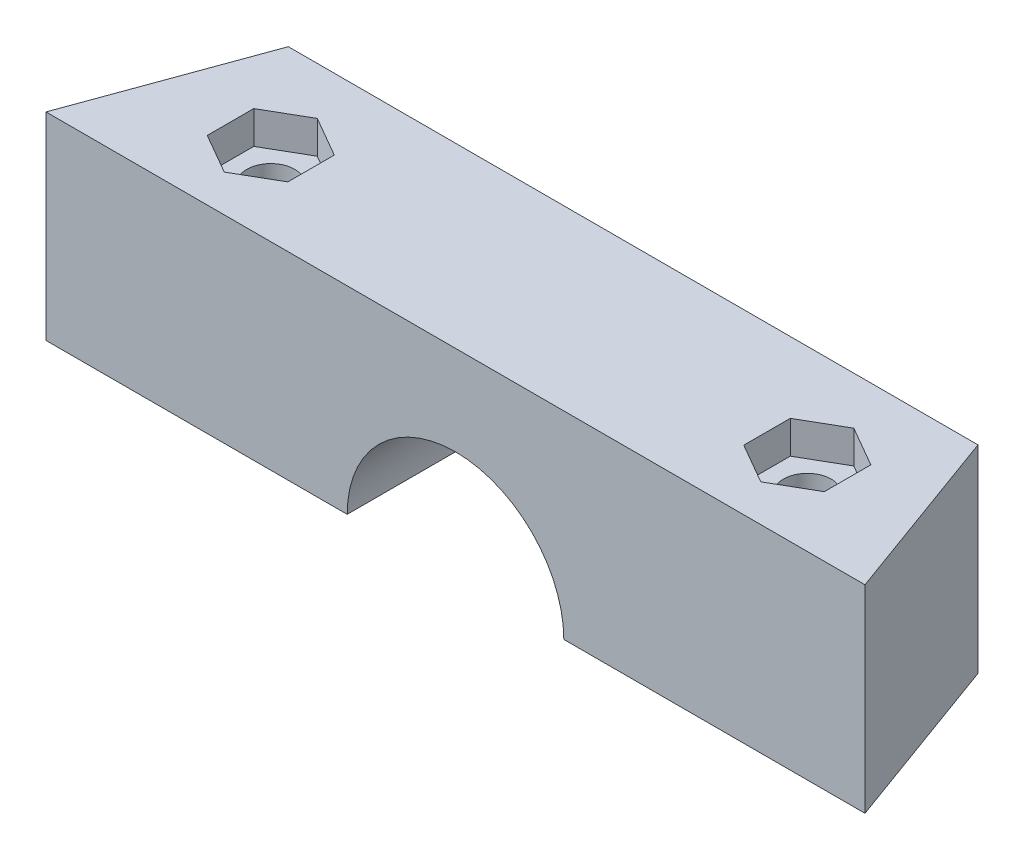
ISO-10303-21;
HEADER;
FILE_DESCRIPTION(('STEP AP214'),'2;1');
FILE_NAME('part.step','',(''),(''),'','','');
FILE_SCHEMA(('AUTOMOTIVE_DESIGN { 1 0 10303 214 1 1 1 1 }'));
ENDSEC;
DATA;
#1=APPLICATION_CONTEXT('core data for automotive mechanical design processes');
#2=APPLICATION_PROTOCOL_DEFINITION('international standard','automotive_design',2000,#1);
#3=PRODUCT_CONTEXT('',#1,'mechanical');
#4=PRODUCT('Part','Part','',(#3));
#5=PRODUCT_RELATED_PRODUCT_CATEGORY('part','',(#4));
#6=PRODUCT_DEFINITION_FORMATION('','',#4);
#7=PRODUCT_DEFINITION_CONTEXT('part definition',#1,'design');
#8=PRODUCT_DEFINITION('design','',#6,#7);
#9=PRODUCT_DEFINITION_SHAPE('','',#8);
#10=(LENGTH_UNIT() NAMED_UNIT(*) SI_UNIT(.MILLI.,.METRE.));
#11=(NAMED_UNIT(*) PLANE_ANGLE_UNIT() SI_UNIT($,.RADIAN.));
#12=(NAMED_UNIT(*) SI_UNIT($,.STERADIAN.) SOLID_ANGLE_UNIT());
#13=UNCERTAINTY_MEASURE_WITH_UNIT(LENGTH_MEASURE(1.E-05),#10,'distance_accuracy_value','');
#14=(GEOMETRIC_REPRESENTATION_CONTEXT(3) GLOBAL_UNCERTAINTY_ASSIGNED_CONTEXT((#13)) GLOBAL_UNIT_ASSIGNED_CONTEXT((#10,
#11,#12)) REPRESENTATION_CONTEXT('',''));
#15=CARTESIAN_POINT('',(0.,0.,0.));
#16=DIRECTION('',(0.,0.,1.));
#17=DIRECTION('',(1.,0.,0.));
#18=AXIS2_PLACEMENT_3D('',#15,#16,#17);
#19=CARTESIAN_POINT('',(0.,0.,0.));
#20=DIRECTION('',(0.,-1.,0.));
#21=DIRECTION('',(0.,0.,-1.));
#22=AXIS2_PLACEMENT_3D('',#19,#20,#21);
#23=PLANE('',#22);
#24=DIRECTION('',(-1.,0.,0.));
#25=VECTOR('',#24,1.);
#26=CARTESIAN_POINT('',(0.,0.,36.1498282890972));
#27=LINE('',#26,#25);
#28=CARTESIAN_POINT('',(18.4255159476194,0.,36.1498282890972));
#29=VERTEX_POINT('',#28);
#30=CARTESIAN_POINT('',(1.09808594402809,0.,36.1498282890972));
#31=VERTEX_POINT('',#30);
#32=EDGE_CURVE('E52',#29,#31,#27,.T.);
#33=ORIENTED_EDGE('',*,*,#32,.F.);
#34=DIRECTION('',(0.342020143325666,0.,0.939692620785909));
#35=VECTOR('',#34,1.);
#36=CARTESIAN_POINT('',(8.16308594402805,0.,7.95403358549623));
#37=LINE('',#36,#35);
#38=CARTESIAN_POINT('',(23.1630859440281,0.,49.166194877316));
#39=VERTEX_POINT('',#38);
#40=EDGE_CURVE('E259',#29,#39,#37,.T.);
#41=ORIENTED_EDGE('',*,*,#40,.T.);
#42=DIRECTION('',(-1.,0.,0.));
#43=VECTOR('',#42,1.);
#44=CARTESIAN_POINT('',(23.1630859440281,0.,49.166194877316));
#45=LINE('',#44,#43);
#46=CARTESIAN_POINT('',(1.09808594402809,0.,49.166194877316));
#47=VERTEX_POINT('',#46);
#48=EDGE_CURVE('E263',#39,#47,#45,.T.);
#49=ORIENTED_EDGE('',*,*,#48,.T.);
#50=DIRECTION('',(0.,0.,1.));
#51=VECTOR('',#50,1.);
#52=CARTESIAN_POINT('',(1.09808594402809,0.,-38.833805122684));
#53=LINE('',#52,#51);
#54=EDGE_CURVE('E45',#31,#47,#53,.T.);
#55=ORIENTED_EDGE('',*,*,#54,.F.);
#56=EDGE_LOOP('',(#33,#41,#49,#55));
#57=FACE_BOUND('',#56,.T.);
#58=DIRECTION('',(0.866025403784438,0.,-0.500000000000001));
#59=VECTOR('',#58,1.);
#60=CARTESIAN_POINT('',(9.86591170632774,0.,41.3430115832066));
#61=LINE('',#60,#59);
#62=CARTESIAN_POINT('',(9.86591170632774,0.,41.3430115832066));
#63=VERTEX_POINT('',#62);
#64=CARTESIAN_POINT('',(12.8159117063277,0.,39.6398282890972));
#65=VERTEX_POINT('',#64);
#66=EDGE_CURVE('E59',#63,#65,#61,.T.);
#67=ORIENTED_EDGE('',*,*,#66,.F.);
#68=DIRECTION('',(0.,0.,-1.));
#69=VECTOR('',#68,1.);
#70=CARTESIAN_POINT('',(9.86591170632774,0.,44.7493781714254));
#71=LINE('',#70,#69);
#72=CARTESIAN_POINT('',(9.86591170632774,0.,44.7493781714254));
#73=VERTEX_POINT('',#72);
#74=EDGE_CURVE('E347',#73,#63,#71,.T.);
#75=ORIENTED_EDGE('',*,*,#74,.F.);
#76=DIRECTION('',(-0.866025403784439,0.,-0.5));
#77=VECTOR('',#76,1.);
#78=CARTESIAN_POINT('',(12.8159117063277,0.,46.4525614655348));
#79=LINE('',#78,#77);
#80=CARTESIAN_POINT('',(12.8159117063277,0.,46.4525614655348));
#81=VERTEX_POINT('',#80);
#82=EDGE_CURVE('E373',#81,#73,#79,.T.);
#83=ORIENTED_EDGE('',*,*,#82,.F.);
#84=DIRECTION('',(-0.866025403784439,0.,0.499999999999999));
#85=VECTOR('',#84,1.);
#86=CARTESIAN_POINT('',(15.7659117063277,0.,44.7493781714254));
#87=LINE('',#86,#85);
#88=CARTESIAN_POINT('',(15.7659117063277,0.,44.7493781714254));
#89=VERTEX_POINT('',#88);
#90=EDGE_CURVE('E370',#89,#81,#87,.T.);
#91=ORIENTED_EDGE('',*,*,#90,.F.);
#92=DIRECTION('',(0.,0.,1.));
#93=VECTOR('',#92,1.);
#94=CARTESIAN_POINT('',(15.7659117063277,0.,41.3430115832066));
#95=LINE('',#94,#93);
#96=CARTESIAN_POINT('',(15.7659117063277,0.,41.3430115832066));
#97=VERTEX_POINT('',#96);
#98=EDGE_CURVE('E367',#97,#89,#95,.T.);
#99=ORIENTED_EDGE('',*,*,#98,.F.);
#100=DIRECTION('',(0.866025403784438,0.,0.500000000000001));
#101=VECTOR('',#100,1.);
#102=CARTESIAN_POINT('',(12.8159117063277,0.,39.6398282890972));
#103=LINE('',#102,#101);
#104=EDGE_CURVE('E364',#65,#97,#103,.T.);
#105=ORIENTED_EDGE('',*,*,#104,.F.);
#106=EDGE_LOOP('',(#67,#75,#83,#91,#99,#105));
#107=FACE_BOUND('',#106,.T.);
#108=ADVANCED_FACE('F37',(#57,#107),#23,.T.);
#109=CARTESIAN_POINT('',(23.1630859440281,14.5,49.166194877316));
#110=DIRECTION('',(0.,0.,1.));
#111=DIRECTION('',(1.,0.,0.));
#112=AXIS2_PLACEMENT_3D('',#109,#110,#111);
#113=PLANE('',#112);
#114=CARTESIAN_POINT('',(-6.83691405597191,0.,49.166194877316));
#115=DIRECTION('',(0.,0.,1.));
#116=DIRECTION('',(1.,0.,0.));
#117=AXIS2_PLACEMENT_3D('',#114,#115,#116);
#118=CIRCLE('',#117,7.935);
#119=CARTESIAN_POINT('',(-14.7719140559719,0.,49.166194877316));
#120=VERTEX_POINT('',#119);
#121=EDGE_CURVE('E427',#47,#120,#118,.T.);
#122=ORIENTED_EDGE('',*,*,#121,.F.);
#123=ORIENTED_EDGE('',*,*,#48,.F.);
#124=DIRECTION('',(0.,-1.,0.));
#125=VECTOR('',#124,1.);
#126=CARTESIAN_POINT('',(23.1630859440281,14.5,49.166194877316));
#127=LINE('',#126,#125);
#128=CARTESIAN_POINT('',(23.1630859440281,14.5,49.166194877316));
#129=VERTEX_POINT('',#128);
#130=EDGE_CURVE('E270',#129,#39,#127,.T.);
#131=ORIENTED_EDGE('',*,*,#130,.F.);
#132=DIRECTION('',(-1.,0.,0.));
#133=VECTOR('',#132,1.);
#134=CARTESIAN_POINT('',(23.1630859440281,14.5,49.166194877316));
#135=LINE('',#134,#133);
#136=CARTESIAN_POINT('',(-36.8369140559719,14.5,49.166194877316));
#137=VERTEX_POINT('',#136);
#138=EDGE_CURVE('E256',#129,#137,#135,.T.);
#139=ORIENTED_EDGE('',*,*,#138,.T.);
#140=DIRECTION('',(0.,-1.,0.));
#141=VECTOR('',#140,1.);
#142=CARTESIAN_POINT('',(-36.8369140559719,14.5,49.166194877316));
#143=LINE('',#142,#141);
#144=CARTESIAN_POINT('',(-36.8369140559719,0.,49.166194877316));
#145=VERTEX_POINT('',#144);
#146=EDGE_CURVE('E255',#137,#145,#143,.T.);
#147=ORIENTED_EDGE('',*,*,#146,.T.);
#148=EDGE_CURVE('E267',#120,#145,#45,.T.);
#149=ORIENTED_EDGE('',*,*,#148,.F.);
#150=EDGE_LOOP('',(#122,#123,#131,#139,#147,#149));
#151=FACE_BOUND('',#150,.T.);
#152=ADVANCED_FACE('F39',(#151),#113,.T.);
#153=CARTESIAN_POINT('',(8.16308594402805,14.5,7.95403358549623));
#154=DIRECTION('',(0.939692620785909,0.,-0.342020143325666));
#155=DIRECTION('',(-0.342020143325666,0.,-0.939692620785909));
#156=AXIS2_PLACEMENT_3D('',#153,#154,#155);
#157=PLANE('',#156);
#158=DIRECTION('',(0.,1.,0.));
#159=VECTOR('',#158,1.);
#160=CARTESIAN_POINT('',(18.4255159476194,-7.9,36.1498282890972));
#161=LINE('',#160,#159);
#162=CARTESIAN_POINT('',(18.4255159476194,14.5,36.1498282890972));
#163=VERTEX_POINT('',#162);
#164=EDGE_CURVE('E242',#29,#163,#161,.T.);
#165=ORIENTED_EDGE('',*,*,#164,.T.);
#166=DIRECTION('',(0.342020143325666,0.,0.939692620785909));
#167=VECTOR('',#166,1.);
#168=CARTESIAN_POINT('',(8.16308594402805,14.5,7.95403358549623));
#169=LINE('',#168,#167);
#170=EDGE_CURVE('E251',#163,#129,#169,.T.);
#171=ORIENTED_EDGE('',*,*,#170,.T.);
#172=ORIENTED_EDGE('',*,*,#130,.T.);
#173=ORIENTED_EDGE('',*,*,#40,.F.);
#174=EDGE_LOOP('',(#165,#171,#172,#173));
#175=FACE_BOUND('',#174,.T.);
#176=ADVANCED_FACE('F495',(#175),#157,.T.);
#177=CARTESIAN_POINT('',(-36.8369140559719,14.5,49.166194877316));
#178=DIRECTION('',(-0.93969262078591,0.,-0.342020143325665));
#179=DIRECTION('',(-0.342020143325665,0.,0.93969262078591));
#180=AXIS2_PLACEMENT_3D('',#177,#178,#179);
#181=PLANE('',#180);
#182=DIRECTION('',(0.,1.,0.));
#183=VECTOR('',#182,1.);
#184=CARTESIAN_POINT('',(-32.0993440595632,-7.9,36.1498282890972));
#185=LINE('',#184,#183);
#186=CARTESIAN_POINT('',(-32.0993440595632,0.,36.1498282890972));
#187=VERTEX_POINT('',#186);
#188=CARTESIAN_POINT('',(-32.0993440595632,14.5,36.1498282890972));
#189=VERTEX_POINT('',#188);
#190=EDGE_CURVE('E231',#187,#189,#185,.T.);
#191=ORIENTED_EDGE('',*,*,#190,.F.);
#192=DIRECTION('',(0.342020143325665,0.,-0.93969262078591));
#193=VECTOR('',#192,1.);
#194=CARTESIAN_POINT('',(-36.8369140559719,0.,49.166194877316));
#195=LINE('',#194,#193);
#196=EDGE_CURVE('E266',#145,#187,#195,.T.);
#197=ORIENTED_EDGE('',*,*,#196,.F.);
#198=ORIENTED_EDGE('',*,*,#146,.F.);
#199=DIRECTION('',(0.342020143325665,0.,-0.93969262078591));
#200=VECTOR('',#199,1.);
#201=CARTESIAN_POINT('',(-36.8369140559719,14.5,49.166194877316));
#202=LINE('',#201,#200);
#203=EDGE_CURVE('E249',#137,#189,#202,.T.);
#204=ORIENTED_EDGE('',*,*,#203,.T.);
#205=EDGE_LOOP('',(#191,#197,#198,#204));
#206=FACE_BOUND('',#205,.T.);
#207=ADVANCED_FACE('F253',(#206),#181,.T.);
#208=CARTESIAN_POINT('',(0.,14.5,0.));
#209=DIRECTION('',(0.,-1.,0.));
#210=DIRECTION('',(0.,0.,-1.));
#211=AXIS2_PLACEMENT_3D('',#208,#209,#210);
#212=PLANE('',#211);
#213=DIRECTION('',(0.866025403784439,0.,-0.5));
#214=VECTOR('',#213,1.);
#215=CARTESIAN_POINT('',(-26.4897398182716,14.5,46.4525614655348));
#216=LINE('',#215,#214);
#217=CARTESIAN_POINT('',(-26.4897398182716,14.5,46.4525614655348));
#218=VERTEX_POINT('',#217);
#219=CARTESIAN_POINT('',(-23.5397398182716,14.5,44.7493781714254));
#220=VERTEX_POINT('',#219);
#221=EDGE_CURVE('E410',#218,#220,#216,.T.);
#222=ORIENTED_EDGE('',*,*,#221,.F.);
#223=DIRECTION('',(0.866025403784439,0.,0.5));
#224=VECTOR('',#223,1.);
#225=CARTESIAN_POINT('',(-29.4397398182716,14.5,44.7493781714254));
#226=LINE('',#225,#224);
#227=CARTESIAN_POINT('',(-29.4397398182716,14.5,44.7493781714254));
#228=VERTEX_POINT('',#227);
#229=EDGE_CURVE('E408',#228,#218,#226,.T.);
#230=ORIENTED_EDGE('',*,*,#229,.F.);
#231=DIRECTION('',(0.,0.,1.));
#232=VECTOR('',#231,1.);
#233=CARTESIAN_POINT('',(-29.4397398182716,14.5,41.3430115832066));
#234=LINE('',#233,#232);
#235=CARTESIAN_POINT('',(-29.4397398182716,14.5,41.3430115832066));
#236=VERTEX_POINT('',#235);
#237=EDGE_CURVE('E392',#236,#228,#234,.T.);
#238=ORIENTED_EDGE('',*,*,#237,.F.);
#239=DIRECTION('',(-0.866025403784439,0.,0.499999999999999));
#240=VECTOR('',#239,1.);
#241=CARTESIAN_POINT('',(-26.4897398182716,14.5,39.6398282890972));
#242=LINE('',#241,#240);
#243=CARTESIAN_POINT('',(-26.4897398182716,14.5,39.6398282890972));
#244=VERTEX_POINT('',#243);
#245=EDGE_CURVE('E420',#244,#236,#242,.T.);
#246=ORIENTED_EDGE('',*,*,#245,.F.);
#247=DIRECTION('',(-0.866025403784439,0.,-0.499999999999999));
#248=VECTOR('',#247,1.);
#249=CARTESIAN_POINT('',(-23.5397398182716,14.5,41.3430115832066));
#250=LINE('',#249,#248);
#251=CARTESIAN_POINT('',(-23.5397398182716,14.5,41.3430115832066));
#252=VERTEX_POINT('',#251);
#253=EDGE_CURVE('E417',#252,#244,#250,.T.);
#254=ORIENTED_EDGE('',*,*,#253,.F.);
#255=DIRECTION('',(0.,0.,-1.));
#256=VECTOR('',#255,1.);
#257=CARTESIAN_POINT('',(-23.5397398182716,14.5,44.7493781714254));
#258=LINE('',#257,#256);
#259=EDGE_CURVE('E414',#220,#252,#258,.T.);
#260=ORIENTED_EDGE('',*,*,#259,.F.);
#261=EDGE_LOOP('',(#222,#230,#238,#246,#254,#260));
#262=FACE_BOUND('',#261,.T.);
#263=DIRECTION('',(0.866025403784439,0.,-0.499999999999999));
#264=VECTOR('',#263,1.);
#265=CARTESIAN_POINT('',(12.8159117063277,14.5,46.4525614655348));
#266=LINE('',#265,#264);
#267=CARTESIAN_POINT('',(12.8159117063277,14.5,46.4525614655348));
#268=VERTEX_POINT('',#267);
#269=CARTESIAN_POINT('',(15.7659117063277,14.5,44.7493781714254));
#270=VERTEX_POINT('',#269);
#271=EDGE_CURVE('E459',#268,#270,#266,.T.);
#272=ORIENTED_EDGE('',*,*,#271,.F.);
#273=DIRECTION('',(0.866025403784439,0.,0.5));
#274=VECTOR('',#273,1.);
#275=CARTESIAN_POINT('',(9.86591170632773,14.5,44.7493781714254));
#276=LINE('',#275,#274);
#277=CARTESIAN_POINT('',(9.86591170632773,14.5,44.7493781714254));
#278=VERTEX_POINT('',#277);
#279=EDGE_CURVE('E332',#278,#268,#276,.T.);
#280=ORIENTED_EDGE('',*,*,#279,.F.);
#281=DIRECTION('',(0.,0.,1.));
#282=VECTOR('',#281,1.);
#283=CARTESIAN_POINT('',(9.86591170632773,14.5,41.3430115832066));
#284=LINE('',#283,#282);
#285=CARTESIAN_POINT('',(9.86591170632773,14.5,41.3430115832066));
#286=VERTEX_POINT('',#285);
#287=EDGE_CURVE('E442',#286,#278,#284,.T.);
#288=ORIENTED_EDGE('',*,*,#287,.F.);
#289=DIRECTION('',(-0.866025403784439,0.,0.499999999999999));
#290=VECTOR('',#289,1.);
#291=CARTESIAN_POINT('',(12.8159117063277,14.5,39.6398282890972));
#292=LINE('',#291,#290);
#293=CARTESIAN_POINT('',(12.8159117063277,14.5,39.6398282890972));
#294=VERTEX_POINT('',#293);
#295=EDGE_CURVE('E468',#294,#286,#292,.T.);
#296=ORIENTED_EDGE('',*,*,#295,.F.);
#297=DIRECTION('',(-0.866025403784439,0.,-0.499999999999999));
#298=VECTOR('',#297,1.);
#299=CARTESIAN_POINT('',(15.7659117063277,14.5,41.3430115832066));
#300=LINE('',#299,#298);
#301=CARTESIAN_POINT('',(15.7659117063277,14.5,41.3430115832066));
#302=VERTEX_POINT('',#301);
#303=EDGE_CURVE('E465',#302,#294,#300,.T.);
#304=ORIENTED_EDGE('',*,*,#303,.F.);
#305=DIRECTION('',(0.,0.,-1.));
#306=VECTOR('',#305,1.);
#307=CARTESIAN_POINT('',(15.7659117063277,14.5,44.7493781714254));
#308=LINE('',#307,#306);
#309=EDGE_CURVE('E462',#270,#302,#308,.T.);
#310=ORIENTED_EDGE('',*,*,#309,.F.);
#311=EDGE_LOOP('',(#272,#280,#288,#296,#304,#310));
#312=FACE_BOUND('',#311,.T.);
#313=ORIENTED_EDGE('',*,*,#170,.F.);
#314=DIRECTION('',(1.,0.,0.));
#315=VECTOR('',#314,1.);
#316=CARTESIAN_POINT('',(-32.0993440595632,14.5,36.1498282890972));
#317=LINE('',#316,#315);
#318=EDGE_CURVE('E234',#189,#163,#317,.T.);
#319=ORIENTED_EDGE('',*,*,#318,.F.);
#320=ORIENTED_EDGE('',*,*,#203,.F.);
#321=ORIENTED_EDGE('',*,*,#138,.F.);
#322=EDGE_LOOP('',(#313,#319,#320,#321));
#323=FACE_BOUND('',#322,.T.);
#324=ADVANCED_FACE('F247',(#262,#312,#323),#212,.F.);
#325=DIRECTION('',(-1.,0.,0.));
#326=VECTOR('',#325,1.);
#327=CARTESIAN_POINT('',(0.,0.,36.1498282890972));
#328=LINE('',#327,#326);
#329=CARTESIAN_POINT('',(-14.7719140559719,0.,36.1498282890972));
#330=VERTEX_POINT('',#329);
#331=EDGE_CURVE('E237',#330,#187,#328,.T.);
#332=ORIENTED_EDGE('',*,*,#331,.F.);
#333=DIRECTION('',(0.,0.,1.));
#334=VECTOR('',#333,1.);
#335=CARTESIAN_POINT('',(-14.7719140559719,0.,-38.833805122684));
#336=LINE('',#335,#334);
#337=EDGE_CURVE('E273',#120,#330,#336,.F.);
#338=ORIENTED_EDGE('',*,*,#337,.F.);
#339=ORIENTED_EDGE('',*,*,#148,.T.);
#340=ORIENTED_EDGE('',*,*,#196,.T.);
#341=EDGE_LOOP('',(#332,#338,#339,#340));
#342=FACE_BOUND('',#341,.T.);
#343=DIRECTION('',(0.866025403784438,0.,-0.500000000000001));
#344=VECTOR('',#343,1.);
#345=CARTESIAN_POINT('',(-29.4397398182716,0.,41.3430115832066));
#346=LINE('',#345,#344);
#347=CARTESIAN_POINT('',(-29.4397398182716,0.,41.3430115832066));
#348=VERTEX_POINT('',#347);
#349=CARTESIAN_POINT('',(-26.4897398182716,0.,39.6398282890972));
#350=VERTEX_POINT('',#349);
#351=EDGE_CURVE('E313',#348,#350,#346,.T.);
#352=ORIENTED_EDGE('',*,*,#351,.F.);
#353=DIRECTION('',(0.,0.,-1.));
#354=VECTOR('',#353,1.);
#355=CARTESIAN_POINT('',(-29.4397398182716,0.,44.7493781714254));
#356=LINE('',#355,#354);
#357=CARTESIAN_POINT('',(-29.4397398182716,0.,44.7493781714254));
#358=VERTEX_POINT('',#357);
#359=EDGE_CURVE('E297',#358,#348,#356,.T.);
#360=ORIENTED_EDGE('',*,*,#359,.F.);
#361=DIRECTION('',(-0.866025403784439,0.,-0.499999999999999));
#362=VECTOR('',#361,1.);
#363=CARTESIAN_POINT('',(-26.4897398182716,0.,46.4525614655348));
#364=LINE('',#363,#362);
#365=CARTESIAN_POINT('',(-26.4897398182716,0.,46.4525614655348));
#366=VERTEX_POINT('',#365);
#367=EDGE_CURVE('E325',#366,#358,#364,.T.);
#368=ORIENTED_EDGE('',*,*,#367,.F.);
#369=DIRECTION('',(-0.866025403784439,0.,0.499999999999999));
#370=VECTOR('',#369,1.);
#371=CARTESIAN_POINT('',(-23.5397398182716,0.,44.7493781714254));
#372=LINE('',#371,#370);
#373=CARTESIAN_POINT('',(-23.5397398182716,0.,44.7493781714254));
#374=VERTEX_POINT('',#373);
#375=EDGE_CURVE('E322',#374,#366,#372,.T.);
#376=ORIENTED_EDGE('',*,*,#375,.F.);
#377=DIRECTION('',(0.,0.,1.));
#378=VECTOR('',#377,1.);
#379=CARTESIAN_POINT('',(-23.5397398182716,0.,41.3430115832066));
#380=LINE('',#379,#378);
#381=CARTESIAN_POINT('',(-23.5397398182716,0.,41.3430115832066));
#382=VERTEX_POINT('',#381);
#383=EDGE_CURVE('E319',#382,#374,#380,.T.);
#384=ORIENTED_EDGE('',*,*,#383,.F.);
#385=DIRECTION('',(0.866025403784439,0.,0.5));
#386=VECTOR('',#385,1.);
#387=CARTESIAN_POINT('',(-26.4897398182716,0.,39.6398282890972));
#388=LINE('',#387,#386);
#389=EDGE_CURVE('E315',#350,#382,#388,.T.);
#390=ORIENTED_EDGE('',*,*,#389,.F.);
#391=EDGE_LOOP('',(#352,#360,#368,#376,#384,#390));
#392=FACE_BOUND('',#391,.T.);
#393=ADVANCED_FACE('F488',(#342,#392),#23,.T.);
#394=CARTESIAN_POINT('',(-6.83691405597191,0.,-38.833805122684));
#395=DIRECTION('',(0.,0.,1.));
#396=DIRECTION('',(1.,0.,0.));
#397=AXIS2_PLACEMENT_3D('',#394,#395,#396);
#398=CYLINDRICAL_SURFACE('',#397,7.935);
#399=ORIENTED_EDGE('',*,*,#337,.T.);
#400=CARTESIAN_POINT('',(-6.83691405597191,0.,36.1498282890972));
#401=DIRECTION('',(0.,0.,1.));
#402=DIRECTION('',(1.,0.,0.));
#403=AXIS2_PLACEMENT_3D('',#400,#401,#402);
#404=CIRCLE('',#403,7.935);
#405=EDGE_CURVE('E11',#330,#31,#404,.F.);
#406=ORIENTED_EDGE('',*,*,#405,.T.);
#407=ORIENTED_EDGE('',*,*,#54,.T.);
#408=ORIENTED_EDGE('',*,*,#121,.T.);
#409=EDGE_LOOP('',(#399,#406,#407,#408));
#410=FACE_BOUND('',#409,.T.);
#411=ADVANCED_FACE('F500',(#410),#398,.F.);
#412=CARTESIAN_POINT('',(9.86591170632773,12.1,44.7493781714254));
#413=DIRECTION('',(-0.5,0.,0.866025403784439));
#414=DIRECTION('',(0.866025403784439,0.,0.5));
#415=AXIS2_PLACEMENT_3D('',#412,#413,#414);
#416=PLANE('',#415);
#417=ORIENTED_EDGE('',*,*,#279,.T.);
#418=DIRECTION('',(0.,1.,0.));
#419=VECTOR('',#418,1.);
#420=CARTESIAN_POINT('',(12.8159117063277,12.1,46.4525614655348));
#421=LINE('',#420,#419);
#422=CARTESIAN_POINT('',(12.8159117063277,12.1,46.4525614655348));
#423=VERTEX_POINT('',#422);
#424=EDGE_CURVE('E457',#423,#268,#421,.T.);
#425=ORIENTED_EDGE('',*,*,#424,.F.);
#426=DIRECTION('',(0.866025403784439,0.,0.5));
#427=VECTOR('',#426,1.);
#428=CARTESIAN_POINT('',(9.86591170632773,12.1,44.7493781714254));
#429=LINE('',#428,#427);
#430=CARTESIAN_POINT('',(9.86591170632773,12.1,44.7493781714254));
#431=VERTEX_POINT('',#430);
#432=EDGE_CURVE('E438',#431,#423,#429,.T.);
#433=ORIENTED_EDGE('',*,*,#432,.F.);
#434=DIRECTION('',(0.,1.,0.));
#435=VECTOR('',#434,1.);
#436=CARTESIAN_POINT('',(9.86591170632773,12.1,44.7493781714254));
#437=LINE('',#436,#435);
#438=EDGE_CURVE('E411',#431,#278,#437,.T.);
#439=ORIENTED_EDGE('',*,*,#438,.T.);
#440=EDGE_LOOP('',(#417,#425,#433,#439));
#441=FACE_BOUND('',#440,.T.);
#442=ADVANCED_FACE('F502',(#441),#416,.F.);
#443=CARTESIAN_POINT('',(9.86591170632773,12.1,41.3430115832066));
#444=DIRECTION('',(-1.,0.,0.));
#445=DIRECTION('',(0.,0.,1.));
#446=AXIS2_PLACEMENT_3D('',#443,#444,#445);
#447=PLANE('',#446);
#448=ORIENTED_EDGE('',*,*,#287,.T.);
#449=ORIENTED_EDGE('',*,*,#438,.F.);
#450=DIRECTION('',(0.,0.,1.));
#451=VECTOR('',#450,1.);
#452=CARTESIAN_POINT('',(9.86591170632773,12.1,41.3430115832066));
#453=LINE('',#452,#451);
#454=CARTESIAN_POINT('',(9.86591170632773,12.1,41.3430115832066));
#455=VERTEX_POINT('',#454);
#456=EDGE_CURVE('E454',#455,#431,#453,.T.);
#457=ORIENTED_EDGE('',*,*,#456,.F.);
#458=DIRECTION('',(0.,1.,0.));
#459=VECTOR('',#458,1.);
#460=CARTESIAN_POINT('',(9.86591170632773,12.1,41.3430115832066));
#461=LINE('',#460,#459);
#462=EDGE_CURVE('E474',#455,#286,#461,.T.);
#463=ORIENTED_EDGE('',*,*,#462,.T.);
#464=EDGE_LOOP('',(#448,#449,#457,#463));
#465=FACE_BOUND('',#464,.T.);
#466=ADVANCED_FACE('F508',(#465),#447,.F.);
#467=CARTESIAN_POINT('',(12.8159117063277,12.1,39.6398282890972));
#468=DIRECTION('',(-0.499999999999999,0.,-0.866025403784439));
#469=DIRECTION('',(-0.866025403784439,0.,0.499999999999999));
#470=AXIS2_PLACEMENT_3D('',#467,#468,#469);
#471=PLANE('',#470);
#472=ORIENTED_EDGE('',*,*,#295,.T.);
#473=ORIENTED_EDGE('',*,*,#462,.F.);
#474=DIRECTION('',(-0.866025403784439,0.,0.499999999999999));
#475=VECTOR('',#474,1.);
#476=CARTESIAN_POINT('',(12.8159117063277,12.1,39.6398282890972));
#477=LINE('',#476,#475);
#478=CARTESIAN_POINT('',(12.8159117063277,12.1,39.6398282890972));
#479=VERTEX_POINT('',#478);
#480=EDGE_CURVE('E451',#479,#455,#477,.T.);
#481=ORIENTED_EDGE('',*,*,#480,.F.);
#482=DIRECTION('',(0.,1.,0.));
#483=VECTOR('',#482,1.);
#484=CARTESIAN_POINT('',(12.8159117063277,12.1,39.6398282890972));
#485=LINE('',#484,#483);
#486=EDGE_CURVE('E476',#479,#294,#485,.T.);
#487=ORIENTED_EDGE('',*,*,#486,.T.);
#488=EDGE_LOOP('',(#472,#473,#481,#487));
#489=FACE_BOUND('',#488,.T.);
#490=ADVANCED_FACE('F544',(#489),#471,.F.);
#491=CARTESIAN_POINT('',(15.7659117063277,12.1,41.3430115832066));
#492=DIRECTION('',(0.499999999999999,0.,-0.866025403784439));
#493=DIRECTION('',(-0.866025403784439,0.,-0.499999999999999));
#494=AXIS2_PLACEMENT_3D('',#491,#492,#493);
#495=PLANE('',#494);
#496=ORIENTED_EDGE('',*,*,#303,.T.);
#497=ORIENTED_EDGE('',*,*,#486,.F.);
#498=DIRECTION('',(-0.866025403784439,0.,-0.499999999999999));
#499=VECTOR('',#498,1.);
#500=CARTESIAN_POINT('',(15.7659117063277,12.1,41.3430115832066));
#501=LINE('',#500,#499);
#502=CARTESIAN_POINT('',(15.7659117063277,12.1,41.3430115832066));
#503=VERTEX_POINT('',#502);
#504=EDGE_CURVE('E448',#503,#479,#501,.T.);
#505=ORIENTED_EDGE('',*,*,#504,.F.);
#506=DIRECTION('',(0.,1.,0.));
#507=VECTOR('',#506,1.);
#508=CARTESIAN_POINT('',(15.7659117063277,12.1,41.3430115832066));
#509=LINE('',#508,#507);
#510=EDGE_CURVE('E478',#503,#302,#509,.T.);
#511=ORIENTED_EDGE('',*,*,#510,.T.);
#512=EDGE_LOOP('',(#496,#497,#505,#511));
#513=FACE_BOUND('',#512,.T.);
#514=ADVANCED_FACE('F548',(#513),#495,.F.);
#515=CARTESIAN_POINT('',(15.7659117063277,12.1,44.7493781714254));
#516=DIRECTION('',(1.,0.,0.));
#517=DIRECTION('',(0.,0.,-1.));
#518=AXIS2_PLACEMENT_3D('',#515,#516,#517);
#519=PLANE('',#518);
#520=ORIENTED_EDGE('',*,*,#309,.T.);
#521=ORIENTED_EDGE('',*,*,#510,.F.);
#522=DIRECTION('',(0.,0.,-1.));
#523=VECTOR('',#522,1.);
#524=CARTESIAN_POINT('',(15.7659117063277,12.1,44.7493781714254));
#525=LINE('',#524,#523);
#526=CARTESIAN_POINT('',(15.7659117063277,12.1,44.7493781714254));
#527=VERTEX_POINT('',#526);
#528=EDGE_CURVE('E445',#527,#503,#525,.T.);
#529=ORIENTED_EDGE('',*,*,#528,.F.);
#530=DIRECTION('',(0.,1.,0.));
#531=VECTOR('',#530,1.);
#532=CARTESIAN_POINT('',(15.7659117063277,12.1,44.7493781714254));
#533=LINE('',#532,#531);
#534=EDGE_CURVE('E480',#527,#270,#533,.T.);
#535=ORIENTED_EDGE('',*,*,#534,.T.);
#536=EDGE_LOOP('',(#520,#521,#529,#535));
#537=FACE_BOUND('',#536,.T.);
#538=ADVANCED_FACE('F550',(#537),#519,.F.);
#539=CARTESIAN_POINT('',(12.8159117063277,12.1,46.4525614655348));
#540=DIRECTION('',(0.499999999999999,0.,0.866025403784439));
#541=DIRECTION('',(0.866025403784439,0.,-0.499999999999999));
#542=AXIS2_PLACEMENT_3D('',#539,#540,#541);
#543=PLANE('',#542);
#544=ORIENTED_EDGE('',*,*,#271,.T.);
#545=ORIENTED_EDGE('',*,*,#534,.F.);
#546=DIRECTION('',(0.866025403784439,0.,-0.499999999999999));
#547=VECTOR('',#546,1.);
#548=CARTESIAN_POINT('',(12.8159117063277,12.1,46.4525614655348));
#549=LINE('',#548,#547);
#550=EDGE_CURVE('E441',#423,#527,#549,.T.);
#551=ORIENTED_EDGE('',*,*,#550,.F.);
#552=ORIENTED_EDGE('',*,*,#424,.T.);
#553=EDGE_LOOP('',(#544,#545,#551,#552));
#554=FACE_BOUND('',#553,.T.);
#555=ADVANCED_FACE('F536',(#554),#543,.F.);
#556=CARTESIAN_POINT('',(0.,12.1,0.));
#557=DIRECTION('',(0.,1.,0.));
#558=DIRECTION('',(0.,0.,1.));
#559=AXIS2_PLACEMENT_3D('',#556,#557,#558);
#560=PLANE('',#559);
#561=CARTESIAN_POINT('',(12.8159117063277,12.1,43.046194877316));
#562=DIRECTION('',(0.,1.,0.));
#563=DIRECTION('',(0.,0.,1.));
#564=AXIS2_PLACEMENT_3D('',#561,#562,#563);
#565=CIRCLE('',#564,1.75);
#566=CARTESIAN_POINT('',(12.8159117063277,12.1,44.796194877316));
#567=VERTEX_POINT('',#566);
#568=EDGE_CURVE('E278',#567,#567,#565,.T.);
#569=ORIENTED_EDGE('',*,*,#568,.F.);
#570=EDGE_LOOP('',(#569));
#571=FACE_BOUND('',#570,.T.);
#572=ORIENTED_EDGE('',*,*,#432,.T.);
#573=ORIENTED_EDGE('',*,*,#550,.T.);
#574=ORIENTED_EDGE('',*,*,#528,.T.);
#575=ORIENTED_EDGE('',*,*,#504,.T.);
#576=ORIENTED_EDGE('',*,*,#480,.T.);
#577=ORIENTED_EDGE('',*,*,#456,.T.);
#578=EDGE_LOOP('',(#572,#573,#574,#575,#576,#577));
#579=FACE_BOUND('',#578,.T.);
#580=ADVANCED_FACE('F552',(#571,#579),#560,.T.);
#581=CARTESIAN_POINT('',(-29.4397398182716,12.1,44.7493781714254));
#582=DIRECTION('',(-0.5,0.,0.866025403784439));
#583=DIRECTION('',(0.866025403784439,0.,0.5));
#584=AXIS2_PLACEMENT_3D('',#581,#582,#583);
#585=PLANE('',#584);
#586=ORIENTED_EDGE('',*,*,#229,.T.);
#587=DIRECTION('',(0.,1.,0.));
#588=VECTOR('',#587,1.);
#589=CARTESIAN_POINT('',(-26.4897398182716,12.1,46.4525614655348));
#590=LINE('',#589,#588);
#591=CARTESIAN_POINT('',(-26.4897398182716,12.1,46.4525614655348));
#592=VERTEX_POINT('',#591);
#593=EDGE_CURVE('E407',#592,#218,#590,.T.);
#594=ORIENTED_EDGE('',*,*,#593,.F.);
#595=DIRECTION('',(0.866025403784439,0.,0.5));
#596=VECTOR('',#595,1.);
#597=CARTESIAN_POINT('',(-29.4397398182716,12.1,44.7493781714254));
#598=LINE('',#597,#596);
#599=CARTESIAN_POINT('',(-29.4397398182716,12.1,44.7493781714254));
#600=VERTEX_POINT('',#599);
#601=EDGE_CURVE('E388',#600,#592,#598,.T.);
#602=ORIENTED_EDGE('',*,*,#601,.F.);
#603=DIRECTION('',(0.,1.,0.));
#604=VECTOR('',#603,1.);
#605=CARTESIAN_POINT('',(-29.4397398182716,12.1,44.7493781714254));
#606=LINE('',#605,#604);
#607=EDGE_CURVE('E425',#600,#228,#606,.T.);
#608=ORIENTED_EDGE('',*,*,#607,.T.);
#609=EDGE_LOOP('',(#586,#594,#602,#608));
#610=FACE_BOUND('',#609,.T.);
#611=ADVANCED_FACE('F554',(#610),#585,.F.);
#612=CARTESIAN_POINT('',(-29.4397398182716,12.1,41.3430115832066));
#613=DIRECTION('',(-1.,0.,0.));
#614=DIRECTION('',(0.,0.,1.));
#615=AXIS2_PLACEMENT_3D('',#612,#613,#614);
#616=PLANE('',#615);
#617=ORIENTED_EDGE('',*,*,#237,.T.);
#618=ORIENTED_EDGE('',*,*,#607,.F.);
#619=DIRECTION('',(0.,0.,1.));
#620=VECTOR('',#619,1.);
#621=CARTESIAN_POINT('',(-29.4397398182716,12.1,41.3430115832066));
#622=LINE('',#621,#620);
#623=CARTESIAN_POINT('',(-29.4397398182716,12.1,41.3430115832066));
#624=VERTEX_POINT('',#623);
#625=EDGE_CURVE('E404',#624,#600,#622,.T.);
#626=ORIENTED_EDGE('',*,*,#625,.F.);
#627=DIRECTION('',(0.,1.,0.));
#628=VECTOR('',#627,1.);
#629=CARTESIAN_POINT('',(-29.4397398182716,12.1,41.3430115832066));
#630=LINE('',#629,#628);
#631=EDGE_CURVE('E428',#624,#236,#630,.T.);
#632=ORIENTED_EDGE('',*,*,#631,.T.);
#633=EDGE_LOOP('',(#617,#618,#626,#632));
#634=FACE_BOUND('',#633,.T.);
#635=ADVANCED_FACE('F561',(#634),#616,.F.);
#636=CARTESIAN_POINT('',(-26.4897398182716,12.1,39.6398282890972));
#637=DIRECTION('',(-0.499999999999999,0.,-0.866025403784439));
#638=DIRECTION('',(-0.866025403784439,0.,0.499999999999999));
#639=AXIS2_PLACEMENT_3D('',#636,#637,#638);
#640=PLANE('',#639);
#641=ORIENTED_EDGE('',*,*,#245,.T.);
#642=ORIENTED_EDGE('',*,*,#631,.F.);
#643=DIRECTION('',(-0.866025403784439,0.,0.499999999999999));
#644=VECTOR('',#643,1.);
#645=CARTESIAN_POINT('',(-26.4897398182716,12.1,39.6398282890972));
#646=LINE('',#645,#644);
#647=CARTESIAN_POINT('',(-26.4897398182716,12.1,39.6398282890972));
#648=VERTEX_POINT('',#647);
#649=EDGE_CURVE('E401',#648,#624,#646,.T.);
#650=ORIENTED_EDGE('',*,*,#649,.F.);
#651=DIRECTION('',(0.,1.,0.));
#652=VECTOR('',#651,1.);
#653=CARTESIAN_POINT('',(-26.4897398182716,12.1,39.6398282890972));
#654=LINE('',#653,#652);
#655=EDGE_CURVE('E430',#648,#244,#654,.T.);
#656=ORIENTED_EDGE('',*,*,#655,.T.);
#657=EDGE_LOOP('',(#641,#642,#650,#656));
#658=FACE_BOUND('',#657,.T.);
#659=ADVANCED_FACE('F599',(#658),#640,.F.);
#660=CARTESIAN_POINT('',(-23.5397398182716,12.1,41.3430115832066));
#661=DIRECTION('',(0.499999999999999,0.,-0.866025403784439));
#662=DIRECTION('',(-0.866025403784439,0.,-0.499999999999999));
#663=AXIS2_PLACEMENT_3D('',#660,#661,#662);
#664=PLANE('',#663);
#665=ORIENTED_EDGE('',*,*,#253,.T.);
#666=ORIENTED_EDGE('',*,*,#655,.F.);
#667=DIRECTION('',(-0.866025403784439,0.,-0.499999999999999));
#668=VECTOR('',#667,1.);
#669=CARTESIAN_POINT('',(-23.5397398182716,12.1,41.3430115832066));
#670=LINE('',#669,#668);
#671=CARTESIAN_POINT('',(-23.5397398182716,12.1,41.3430115832066));
#672=VERTEX_POINT('',#671);
#673=EDGE_CURVE('E398',#672,#648,#670,.T.);
#674=ORIENTED_EDGE('',*,*,#673,.F.);
#675=DIRECTION('',(0.,1.,0.));
#676=VECTOR('',#675,1.);
#677=CARTESIAN_POINT('',(-23.5397398182716,12.1,41.3430115832066));
#678=LINE('',#677,#676);
#679=EDGE_CURVE('E432',#672,#252,#678,.T.);
#680=ORIENTED_EDGE('',*,*,#679,.T.);
#681=EDGE_LOOP('',(#665,#666,#674,#680));
#682=FACE_BOUND('',#681,.T.);
#683=ADVANCED_FACE('F609',(#682),#664,.F.);
#684=CARTESIAN_POINT('',(-23.5397398182716,12.1,44.7493781714254));
#685=DIRECTION('',(1.,0.,0.));
#686=DIRECTION('',(0.,0.,-1.));
#687=AXIS2_PLACEMENT_3D('',#684,#685,#686);
#688=PLANE('',#687);
#689=ORIENTED_EDGE('',*,*,#259,.T.);
#690=ORIENTED_EDGE('',*,*,#679,.F.);
#691=DIRECTION('',(0.,0.,-1.));
#692=VECTOR('',#691,1.);
#693=CARTESIAN_POINT('',(-23.5397398182716,12.1,44.7493781714254));
#694=LINE('',#693,#692);
#695=CARTESIAN_POINT('',(-23.5397398182716,12.1,44.7493781714254));
#696=VERTEX_POINT('',#695);
#697=EDGE_CURVE('E395',#696,#672,#694,.T.);
#698=ORIENTED_EDGE('',*,*,#697,.F.);
#699=DIRECTION('',(0.,1.,0.));
#700=VECTOR('',#699,1.);
#701=CARTESIAN_POINT('',(-23.5397398182716,12.1,44.7493781714254));
#702=LINE('',#701,#700);
#703=EDGE_CURVE('E434',#696,#220,#702,.T.);
#704=ORIENTED_EDGE('',*,*,#703,.T.);
#705=EDGE_LOOP('',(#689,#690,#698,#704));
#706=FACE_BOUND('',#705,.T.);
#707=ADVANCED_FACE('F619',(#706),#688,.F.);
#708=CARTESIAN_POINT('',(-26.4897398182716,12.1,46.4525614655348));
#709=DIRECTION('',(0.5,0.,0.866025403784439));
#710=DIRECTION('',(0.866025403784439,0.,-0.5));
#711=AXIS2_PLACEMENT_3D('',#708,#709,#710);
#712=PLANE('',#711);
#713=ORIENTED_EDGE('',*,*,#221,.T.);
#714=ORIENTED_EDGE('',*,*,#703,.F.);
#715=DIRECTION('',(0.866025403784439,0.,-0.5));
#716=VECTOR('',#715,1.);
#717=CARTESIAN_POINT('',(-26.4897398182716,12.1,46.4525614655348));
#718=LINE('',#717,#716);
#719=EDGE_CURVE('E391',#592,#696,#718,.T.);
#720=ORIENTED_EDGE('',*,*,#719,.F.);
#721=ORIENTED_EDGE('',*,*,#593,.T.);
#722=EDGE_LOOP('',(#713,#714,#720,#721));
#723=FACE_BOUND('',#722,.T.);
#724=ADVANCED_FACE('F629',(#723),#712,.F.);
#725=CARTESIAN_POINT('',(0.,12.1,0.));
#726=DIRECTION('',(0.,1.,0.));
#727=DIRECTION('',(0.,0.,1.));
#728=AXIS2_PLACEMENT_3D('',#725,#726,#727);
#729=PLANE('',#728);
#730=CARTESIAN_POINT('',(-26.4897398182716,12.1,43.046194877316));
#731=DIRECTION('',(0.,1.,0.));
#732=DIRECTION('',(0.,0.,1.));
#733=AXIS2_PLACEMENT_3D('',#730,#731,#732);
#734=CIRCLE('',#733,1.75);
#735=CARTESIAN_POINT('',(-26.4897398182716,12.1,44.796194877316));
#736=VERTEX_POINT('',#735);
#737=EDGE_CURVE('E281',#736,#736,#734,.T.);
#738=ORIENTED_EDGE('',*,*,#737,.F.);
#739=EDGE_LOOP('',(#738));
#740=FACE_BOUND('',#739,.T.);
#741=ORIENTED_EDGE('',*,*,#601,.T.);
#742=ORIENTED_EDGE('',*,*,#719,.T.);
#743=ORIENTED_EDGE('',*,*,#697,.T.);
#744=ORIENTED_EDGE('',*,*,#673,.T.);
#745=ORIENTED_EDGE('',*,*,#649,.T.);
#746=ORIENTED_EDGE('',*,*,#625,.T.);
#747=EDGE_LOOP('',(#741,#742,#743,#744,#745,#746));
#748=FACE_BOUND('',#747,.T.);
#749=ADVANCED_FACE('F639',(#740,#748),#729,.T.);
#750=CARTESIAN_POINT('',(-29.4397398182716,2.4,41.3430115832066));
#751=DIRECTION('',(-0.500000000000001,0.,-0.866025403784438));
#752=DIRECTION('',(-0.866025403784438,0.,0.500000000000001));
#753=AXIS2_PLACEMENT_3D('',#750,#751,#752);
#754=PLANE('',#753);
#755=ORIENTED_EDGE('',*,*,#351,.T.);
#756=DIRECTION('',(0.,-1.,0.));
#757=VECTOR('',#756,1.);
#758=CARTESIAN_POINT('',(-26.4897398182716,2.4,39.6398282890972));
#759=LINE('',#758,#757);
#760=CARTESIAN_POINT('',(-26.4897398182716,2.4,39.6398282890972));
#761=VERTEX_POINT('',#760);
#762=EDGE_CURVE('E312',#761,#350,#759,.T.);
#763=ORIENTED_EDGE('',*,*,#762,.F.);
#764=DIRECTION('',(0.866025403784438,0.,-0.500000000000001));
#765=VECTOR('',#764,1.);
#766=CARTESIAN_POINT('',(-29.4397398182716,2.4,41.3430115832066));
#767=LINE('',#766,#765);
#768=CARTESIAN_POINT('',(-29.4397398182716,2.4,41.3430115832066));
#769=VERTEX_POINT('',#768);
#770=EDGE_CURVE('E293',#769,#761,#767,.T.);
#771=ORIENTED_EDGE('',*,*,#770,.F.);
#772=DIRECTION('',(0.,-1.,0.));
#773=VECTOR('',#772,1.);
#774=CARTESIAN_POINT('',(-29.4397398182716,2.4,41.3430115832066));
#775=LINE('',#774,#773);
#776=EDGE_CURVE('E330',#769,#348,#775,.T.);
#777=ORIENTED_EDGE('',*,*,#776,.T.);
#778=EDGE_LOOP('',(#755,#763,#771,#777));
#779=FACE_BOUND('',#778,.T.);
#780=ADVANCED_FACE('F646',(#779),#754,.F.);
#781=CARTESIAN_POINT('',(-29.4397398182716,2.4,44.7493781714254));
#782=DIRECTION('',(-1.,0.,0.));
#783=DIRECTION('',(0.,0.,1.));
#784=AXIS2_PLACEMENT_3D('',#781,#782,#783);
#785=PLANE('',#784);
#786=ORIENTED_EDGE('',*,*,#359,.T.);
#787=ORIENTED_EDGE('',*,*,#776,.F.);
#788=DIRECTION('',(0.,0.,-1.));
#789=VECTOR('',#788,1.);
#790=CARTESIAN_POINT('',(-29.4397398182716,2.4,44.7493781714254));
#791=LINE('',#790,#789);
#792=CARTESIAN_POINT('',(-29.4397398182716,2.4,44.7493781714254));
#793=VERTEX_POINT('',#792);
#794=EDGE_CURVE('E309',#793,#769,#791,.T.);
#795=ORIENTED_EDGE('',*,*,#794,.F.);
#796=DIRECTION('',(0.,-1.,0.));
#797=VECTOR('',#796,1.);
#798=CARTESIAN_POINT('',(-29.4397398182716,2.4,44.7493781714254));
#799=LINE('',#798,#797);
#800=EDGE_CURVE('E333',#793,#358,#799,.T.);
#801=ORIENTED_EDGE('',*,*,#800,.T.);
#802=EDGE_LOOP('',(#786,#787,#795,#801));
#803=FACE_BOUND('',#802,.T.);
#804=ADVANCED_FACE('F651',(#803),#785,.F.);
#805=CARTESIAN_POINT('',(-26.4897398182716,2.4,46.4525614655348));
#806=DIRECTION('',(-0.499999999999999,0.,0.866025403784439));
#807=DIRECTION('',(0.866025403784439,0.,0.499999999999999));
#808=AXIS2_PLACEMENT_3D('',#805,#806,#807);
#809=PLANE('',#808);
#810=ORIENTED_EDGE('',*,*,#367,.T.);
#811=ORIENTED_EDGE('',*,*,#800,.F.);
#812=DIRECTION('',(-0.866025403784439,0.,-0.499999999999999));
#813=VECTOR('',#812,1.);
#814=CARTESIAN_POINT('',(-26.4897398182716,2.4,46.4525614655348));
#815=LINE('',#814,#813);
#816=CARTESIAN_POINT('',(-26.4897398182716,2.4,46.4525614655348));
#817=VERTEX_POINT('',#816);
#818=EDGE_CURVE('E306',#817,#793,#815,.T.);
#819=ORIENTED_EDGE('',*,*,#818,.F.);
#820=DIRECTION('',(0.,-1.,0.));
#821=VECTOR('',#820,1.);
#822=CARTESIAN_POINT('',(-26.4897398182716,2.4,46.4525614655348));
#823=LINE('',#822,#821);
#824=EDGE_CURVE('E335',#817,#366,#823,.T.);
#825=ORIENTED_EDGE('',*,*,#824,.T.);
#826=EDGE_LOOP('',(#810,#811,#819,#825));
#827=FACE_BOUND('',#826,.T.);
#828=ADVANCED_FACE('F661',(#827),#809,.F.);
#829=CARTESIAN_POINT('',(-23.5397398182716,2.4,44.7493781714254));
#830=DIRECTION('',(0.499999999999999,0.,0.866025403784439));
#831=DIRECTION('',(0.866025403784439,0.,-0.499999999999999));
#832=AXIS2_PLACEMENT_3D('',#829,#830,#831);
#833=PLANE('',#832);
#834=ORIENTED_EDGE('',*,*,#375,.T.);
#835=ORIENTED_EDGE('',*,*,#824,.F.);
#836=DIRECTION('',(-0.866025403784439,0.,0.499999999999999));
#837=VECTOR('',#836,1.);
#838=CARTESIAN_POINT('',(-23.5397398182716,2.4,44.7493781714254));
#839=LINE('',#838,#837);
#840=CARTESIAN_POINT('',(-23.5397398182716,2.4,44.7493781714254));
#841=VERTEX_POINT('',#840);
#842=EDGE_CURVE('E303',#841,#817,#839,.T.);
#843=ORIENTED_EDGE('',*,*,#842,.F.);
#844=DIRECTION('',(0.,-1.,0.));
#845=VECTOR('',#844,1.);
#846=CARTESIAN_POINT('',(-23.5397398182716,2.4,44.7493781714254));
#847=LINE('',#846,#845);
#848=EDGE_CURVE('E337',#841,#374,#847,.T.);
#849=ORIENTED_EDGE('',*,*,#848,.T.);
#850=EDGE_LOOP('',(#834,#835,#843,#849));
#851=FACE_BOUND('',#850,.T.);
#852=ADVANCED_FACE('F671',(#851),#833,.F.);
#853=CARTESIAN_POINT('',(-23.5397398182716,2.4,41.3430115832066));
#854=DIRECTION('',(1.,0.,0.));
#855=DIRECTION('',(0.,0.,-1.));
#856=AXIS2_PLACEMENT_3D('',#853,#854,#855);
#857=PLANE('',#856);
#858=ORIENTED_EDGE('',*,*,#383,.T.);
#859=ORIENTED_EDGE('',*,*,#848,.F.);
#860=DIRECTION('',(0.,0.,1.));
#861=VECTOR('',#860,1.);
#862=CARTESIAN_POINT('',(-23.5397398182716,2.4,41.3430115832066));
#863=LINE('',#862,#861);
#864=CARTESIAN_POINT('',(-23.5397398182716,2.4,41.3430115832066));
#865=VERTEX_POINT('',#864);
#866=EDGE_CURVE('E300',#865,#841,#863,.T.);
#867=ORIENTED_EDGE('',*,*,#866,.F.);
#868=DIRECTION('',(0.,-1.,0.));
#869=VECTOR('',#868,1.);
#870=CARTESIAN_POINT('',(-23.5397398182716,2.4,41.3430115832066));
#871=LINE('',#870,#869);
#872=EDGE_CURVE('E339',#865,#382,#871,.T.);
#873=ORIENTED_EDGE('',*,*,#872,.T.);
#874=EDGE_LOOP('',(#858,#859,#867,#873));
#875=FACE_BOUND('',#874,.T.);
#876=ADVANCED_FACE('F681',(#875),#857,.F.);
#877=CARTESIAN_POINT('',(-26.4897398182716,2.4,39.6398282890972));
#878=DIRECTION('',(0.5,0.,-0.866025403784438));
#879=DIRECTION('',(-0.866025403784438,0.,-0.5));
#880=AXIS2_PLACEMENT_3D('',#877,#878,#879);
#881=PLANE('',#880);
#882=ORIENTED_EDGE('',*,*,#389,.T.);
#883=ORIENTED_EDGE('',*,*,#872,.F.);
#884=DIRECTION('',(0.866025403784439,0.,0.5));
#885=VECTOR('',#884,1.);
#886=CARTESIAN_POINT('',(-26.4897398182716,2.4,39.6398282890972));
#887=LINE('',#886,#885);
#888=EDGE_CURVE('E296',#761,#865,#887,.T.);
#889=ORIENTED_EDGE('',*,*,#888,.F.);
#890=ORIENTED_EDGE('',*,*,#762,.T.);
#891=EDGE_LOOP('',(#882,#883,#889,#890));
#892=FACE_BOUND('',#891,.T.);
#893=ADVANCED_FACE('F691',(#892),#881,.F.);
#894=CARTESIAN_POINT('',(0.,2.4,0.));
#895=DIRECTION('',(0.,-1.,0.));
#896=DIRECTION('',(0.,0.,-1.));
#897=AXIS2_PLACEMENT_3D('',#894,#895,#896);
#898=PLANE('',#897);
#899=CARTESIAN_POINT('',(-26.4897398182716,2.4,43.046194877316));
#900=DIRECTION('',(0.,-1.,0.));
#901=DIRECTION('',(0.,0.,-1.));
#902=AXIS2_PLACEMENT_3D('',#899,#900,#901);
#903=CIRCLE('',#902,1.75);
#904=CARTESIAN_POINT('',(-26.4897398182716,2.4,41.296194877316));
#905=VERTEX_POINT('',#904);
#906=EDGE_CURVE('E282',#905,#905,#903,.T.);
#907=ORIENTED_EDGE('',*,*,#906,.F.);
#908=EDGE_LOOP('',(#907));
#909=FACE_BOUND('',#908,.T.);
#910=ORIENTED_EDGE('',*,*,#770,.T.);
#911=ORIENTED_EDGE('',*,*,#888,.T.);
#912=ORIENTED_EDGE('',*,*,#866,.T.);
#913=ORIENTED_EDGE('',*,*,#842,.T.);
#914=ORIENTED_EDGE('',*,*,#818,.T.);
#915=ORIENTED_EDGE('',*,*,#794,.T.);
#916=EDGE_LOOP('',(#910,#911,#912,#913,#914,#915));
#917=FACE_BOUND('',#916,.T.);
#918=ADVANCED_FACE('F701',(#909,#917),#898,.T.);
#919=CARTESIAN_POINT('',(9.86591170632774,2.4,41.3430115832066));
#920=DIRECTION('',(-0.500000000000001,0.,-0.866025403784438));
#921=DIRECTION('',(-0.866025403784438,0.,0.500000000000001));
#922=AXIS2_PLACEMENT_3D('',#919,#920,#921);
#923=PLANE('',#922);
#924=ORIENTED_EDGE('',*,*,#66,.T.);
#925=DIRECTION('',(0.,-1.,0.));
#926=VECTOR('',#925,1.);
#927=CARTESIAN_POINT('',(12.8159117063277,2.4,39.6398282890972));
#928=LINE('',#927,#926);
#929=CARTESIAN_POINT('',(12.8159117063277,2.4,39.6398282890972));
#930=VERTEX_POINT('',#929);
#931=EDGE_CURVE('E362',#930,#65,#928,.T.);
#932=ORIENTED_EDGE('',*,*,#931,.F.);
#933=DIRECTION('',(0.866025403784438,0.,-0.500000000000001));
#934=VECTOR('',#933,1.);
#935=CARTESIAN_POINT('',(9.86591170632774,2.4,41.3430115832066));
#936=LINE('',#935,#934);
#937=CARTESIAN_POINT('',(9.86591170632774,2.4,41.3430115832066));
#938=VERTEX_POINT('',#937);
#939=EDGE_CURVE('E343',#938,#930,#936,.T.);
#940=ORIENTED_EDGE('',*,*,#939,.F.);
#941=DIRECTION('',(0.,-1.,0.));
#942=VECTOR('',#941,1.);
#943=CARTESIAN_POINT('',(9.86591170632774,2.4,41.3430115832066));
#944=LINE('',#943,#942);
#945=EDGE_CURVE('E316',#938,#63,#944,.T.);
#946=ORIENTED_EDGE('',*,*,#945,.T.);
#947=EDGE_LOOP('',(#924,#932,#940,#946));
#948=FACE_BOUND('',#947,.T.);
#949=ADVANCED_FACE('F709',(#948),#923,.F.);
#950=CARTESIAN_POINT('',(9.86591170632774,2.4,44.7493781714254));
#951=DIRECTION('',(-1.,0.,0.));
#952=DIRECTION('',(0.,0.,1.));
#953=AXIS2_PLACEMENT_3D('',#950,#951,#952);
#954=PLANE('',#953);
#955=ORIENTED_EDGE('',*,*,#74,.T.);
#956=ORIENTED_EDGE('',*,*,#945,.F.);
#957=DIRECTION('',(0.,0.,-1.));
#958=VECTOR('',#957,1.);
#959=CARTESIAN_POINT('',(9.86591170632774,2.4,44.7493781714254));
#960=LINE('',#959,#958);
#961=CARTESIAN_POINT('',(9.86591170632774,2.4,44.7493781714254));
#962=VERTEX_POINT('',#961);
#963=EDGE_CURVE('E359',#962,#938,#960,.T.);
#964=ORIENTED_EDGE('',*,*,#963,.F.);
#965=DIRECTION('',(0.,-1.,0.));
#966=VECTOR('',#965,1.);
#967=CARTESIAN_POINT('',(9.86591170632774,2.4,44.7493781714254));
#968=LINE('',#967,#966);
#969=EDGE_CURVE('E379',#962,#73,#968,.T.);
#970=ORIENTED_EDGE('',*,*,#969,.T.);
#971=EDGE_LOOP('',(#955,#956,#964,#970));
#972=FACE_BOUND('',#971,.T.);
#973=ADVANCED_FACE('F714',(#972),#954,.F.);
#974=CARTESIAN_POINT('',(12.8159117063277,2.4,46.4525614655348));
#975=DIRECTION('',(-0.499999999999999,0.,0.866025403784439));
#976=DIRECTION('',(0.866025403784439,0.,0.5));
#977=AXIS2_PLACEMENT_3D('',#974,#975,#976);
#978=PLANE('',#977);
#979=ORIENTED_EDGE('',*,*,#82,.T.);
#980=ORIENTED_EDGE('',*,*,#969,.F.);
#981=DIRECTION('',(-0.866025403784439,0.,-0.5));
#982=VECTOR('',#981,1.);
#983=CARTESIAN_POINT('',(12.8159117063277,2.4,46.4525614655348));
#984=LINE('',#983,#982);
#985=CARTESIAN_POINT('',(12.8159117063277,2.4,46.4525614655348));
#986=VERTEX_POINT('',#985);
#987=EDGE_CURVE('E356',#986,#962,#984,.T.);
#988=ORIENTED_EDGE('',*,*,#987,.F.);
#989=DIRECTION('',(0.,-1.,0.));
#990=VECTOR('',#989,1.);
#991=CARTESIAN_POINT('',(12.8159117063277,2.4,46.4525614655348));
#992=LINE('',#991,#990);
#993=EDGE_CURVE('E381',#986,#81,#992,.T.);
#994=ORIENTED_EDGE('',*,*,#993,.T.);
#995=EDGE_LOOP('',(#979,#980,#988,#994));
#996=FACE_BOUND('',#995,.T.);
#997=ADVANCED_FACE('F723',(#996),#978,.F.);
#998=CARTESIAN_POINT('',(15.7659117063277,2.4,44.7493781714254));
#999=DIRECTION('',(0.499999999999999,0.,0.866025403784439));
#1000=DIRECTION('',(0.866025403784439,0.,-0.499999999999999));
#1001=AXIS2_PLACEMENT_3D('',#998,#999,#1000);
#1002=PLANE('',#1001);
#1003=ORIENTED_EDGE('',*,*,#90,.T.);
#1004=ORIENTED_EDGE('',*,*,#993,.F.);
#1005=DIRECTION('',(-0.866025403784439,0.,0.499999999999999));
#1006=VECTOR('',#1005,1.);
#1007=CARTESIAN_POINT('',(15.7659117063277,2.4,44.7493781714254));
#1008=LINE('',#1007,#1006);
#1009=CARTESIAN_POINT('',(15.7659117063277,2.4,44.7493781714254));
#1010=VERTEX_POINT('',#1009);
#1011=EDGE_CURVE('E353',#1010,#986,#1008,.T.);
#1012=ORIENTED_EDGE('',*,*,#1011,.F.);
#1013=DIRECTION('',(0.,-1.,0.));
#1014=VECTOR('',#1013,1.);
#1015=CARTESIAN_POINT('',(15.7659117063277,2.4,44.7493781714254));
#1016=LINE('',#1015,#1014);
#1017=EDGE_CURVE('E383',#1010,#89,#1016,.T.);
#1018=ORIENTED_EDGE('',*,*,#1017,.T.);
#1019=EDGE_LOOP('',(#1003,#1004,#1012,#1018));
#1020=FACE_BOUND('',#1019,.T.);
#1021=ADVANCED_FACE('F733',(#1020),#1002,.F.);
#1022=CARTESIAN_POINT('',(15.7659117063277,2.4,41.3430115832066));
#1023=DIRECTION('',(1.,0.,0.));
#1024=DIRECTION('',(0.,0.,-1.));
#1025=AXIS2_PLACEMENT_3D('',#1022,#1023,#1024);
#1026=PLANE('',#1025);
#1027=ORIENTED_EDGE('',*,*,#98,.T.);
#1028=ORIENTED_EDGE('',*,*,#1017,.F.);
#1029=DIRECTION('',(0.,0.,1.));
#1030=VECTOR('',#1029,1.);
#1031=CARTESIAN_POINT('',(15.7659117063277,2.4,41.3430115832066));
#1032=LINE('',#1031,#1030);
#1033=CARTESIAN_POINT('',(15.7659117063277,2.4,41.3430115832066));
#1034=VERTEX_POINT('',#1033);
#1035=EDGE_CURVE('E350',#1034,#1010,#1032,.T.);
#1036=ORIENTED_EDGE('',*,*,#1035,.F.);
#1037=DIRECTION('',(0.,-1.,0.));
#1038=VECTOR('',#1037,1.);
#1039=CARTESIAN_POINT('',(15.7659117063277,2.4,41.3430115832066));
#1040=LINE('',#1039,#1038);
#1041=EDGE_CURVE('E385',#1034,#97,#1040,.T.);
#1042=ORIENTED_EDGE('',*,*,#1041,.T.);
#1043=EDGE_LOOP('',(#1027,#1028,#1036,#1042));
#1044=FACE_BOUND('',#1043,.T.);
#1045=ADVANCED_FACE('F743',(#1044),#1026,.F.);
#1046=CARTESIAN_POINT('',(12.8159117063277,2.4,39.6398282890972));
#1047=DIRECTION('',(0.500000000000001,0.,-0.866025403784438));
#1048=DIRECTION('',(-0.866025403784438,0.,-0.500000000000001));
#1049=AXIS2_PLACEMENT_3D('',#1046,#1047,#1048);
#1050=PLANE('',#1049);
#1051=ORIENTED_EDGE('',*,*,#104,.T.);
#1052=ORIENTED_EDGE('',*,*,#1041,.F.);
#1053=DIRECTION('',(0.866025403784438,0.,0.500000000000001));
#1054=VECTOR('',#1053,1.);
#1055=CARTESIAN_POINT('',(12.8159117063277,2.4,39.6398282890972));
#1056=LINE('',#1055,#1054);
#1057=EDGE_CURVE('E346',#930,#1034,#1056,.T.);
#1058=ORIENTED_EDGE('',*,*,#1057,.F.);
#1059=ORIENTED_EDGE('',*,*,#931,.T.);
#1060=EDGE_LOOP('',(#1051,#1052,#1058,#1059));
#1061=FACE_BOUND('',#1060,.T.);
#1062=ADVANCED_FACE('F753',(#1061),#1050,.F.);
#1063=CARTESIAN_POINT('',(0.,2.4,0.));
#1064=DIRECTION('',(0.,-1.,0.));
#1065=DIRECTION('',(0.,0.,-1.));
#1066=AXIS2_PLACEMENT_3D('',#1063,#1064,#1065);
#1067=PLANE('',#1066);
#1068=CARTESIAN_POINT('',(12.8159117063277,2.4,43.046194877316));
#1069=DIRECTION('',(0.,-1.,0.));
#1070=DIRECTION('',(0.,0.,-1.));
#1071=AXIS2_PLACEMENT_3D('',#1068,#1069,#1070);
#1072=CIRCLE('',#1071,1.75);
#1073=CARTESIAN_POINT('',(12.8159117063277,2.4,41.296194877316));
#1074=VERTEX_POINT('',#1073);
#1075=EDGE_CURVE('E280',#1074,#1074,#1072,.T.);
#1076=ORIENTED_EDGE('',*,*,#1075,.F.);
#1077=EDGE_LOOP('',(#1076));
#1078=FACE_BOUND('',#1077,.T.);
#1079=ORIENTED_EDGE('',*,*,#939,.T.);
#1080=ORIENTED_EDGE('',*,*,#1057,.T.);
#1081=ORIENTED_EDGE('',*,*,#1035,.T.);
#1082=ORIENTED_EDGE('',*,*,#1011,.T.);
#1083=ORIENTED_EDGE('',*,*,#987,.T.);
#1084=ORIENTED_EDGE('',*,*,#963,.T.);
#1085=EDGE_LOOP('',(#1079,#1080,#1081,#1082,#1083,#1084));
#1086=FACE_BOUND('',#1085,.T.);
#1087=ADVANCED_FACE('F762',(#1078,#1086),#1067,.T.);
#1088=CARTESIAN_POINT('',(12.8159117063277,14.5,43.046194877316));
#1089=DIRECTION('',(0.,1.,0.));
#1090=DIRECTION('',(0.,0.,1.));
#1091=AXIS2_PLACEMENT_3D('',#1088,#1089,#1090);
#1092=CYLINDRICAL_SURFACE('',#1091,1.75);
#1093=ORIENTED_EDGE('',*,*,#1075,.T.);
#1094=EDGE_LOOP('',(#1093));
#1095=FACE_BOUND('',#1094,.T.);
#1096=ORIENTED_EDGE('',*,*,#568,.T.);
#1097=EDGE_LOOP('',(#1096));
#1098=FACE_BOUND('',#1097,.T.);
#1099=ADVANCED_FACE('F790',(#1095,#1098),#1092,.F.);
#1100=CARTESIAN_POINT('',(-26.4897398182716,14.5,43.046194877316));
#1101=DIRECTION('',(0.,1.,0.));
#1102=DIRECTION('',(0.,0.,1.));
#1103=AXIS2_PLACEMENT_3D('',#1100,#1101,#1102);
#1104=CYLINDRICAL_SURFACE('',#1103,1.75);
#1105=ORIENTED_EDGE('',*,*,#737,.T.);
#1106=EDGE_LOOP('',(#1105));
#1107=FACE_BOUND('',#1106,.T.);
#1108=ORIENTED_EDGE('',*,*,#906,.T.);
#1109=EDGE_LOOP('',(#1108));
#1110=FACE_BOUND('',#1109,.T.);
#1111=ADVANCED_FACE('F800',(#1107,#1110),#1104,.F.);
#1112=CARTESIAN_POINT('',(-32.0993440595632,-7.9,36.1498282890972));
#1113=DIRECTION('',(0.,0.,1.));
#1114=DIRECTION('',(1.,0.,0.));
#1115=AXIS2_PLACEMENT_3D('',#1112,#1113,#1114);
#1116=PLANE('',#1115);
#1117=ORIENTED_EDGE('',*,*,#32,.T.);
#1118=ORIENTED_EDGE('',*,*,#405,.F.);
#1119=ORIENTED_EDGE('',*,*,#331,.T.);
#1120=ORIENTED_EDGE('',*,*,#190,.T.);
#1121=ORIENTED_EDGE('',*,*,#318,.T.);
#1122=ORIENTED_EDGE('',*,*,#164,.F.);
#1123=EDGE_LOOP('',(#1117,#1118,#1119,#1120,#1121,#1122));
#1124=FACE_BOUND('',#1123,.T.);
#1125=ADVANCED_FACE('F233',(#1124),#1116,.F.);
#1126=CLOSED_SHELL('',(#108,#152,#176,#207,#324,#393,#411,#442,#466,#490,#514,#538,#555,#580,
#611,#635,#659,#683,#707,#724,#749,#780,#804,#828,#852,#876,#893,#918,#949,#973,#997,#1021,
#1045,#1062,#1087,#1099,#1111,#1125));
#1127=MANIFOLD_SOLID_BREP('B2',#1126);
#1128=ADVANCED_BREP_SHAPE_REPRESENTATION('',(#18,#1127),#14);
#1129=SHAPE_DEFINITION_REPRESENTATION(#9,#1128);
ENDSEC;
END-ISO-10303-21;
